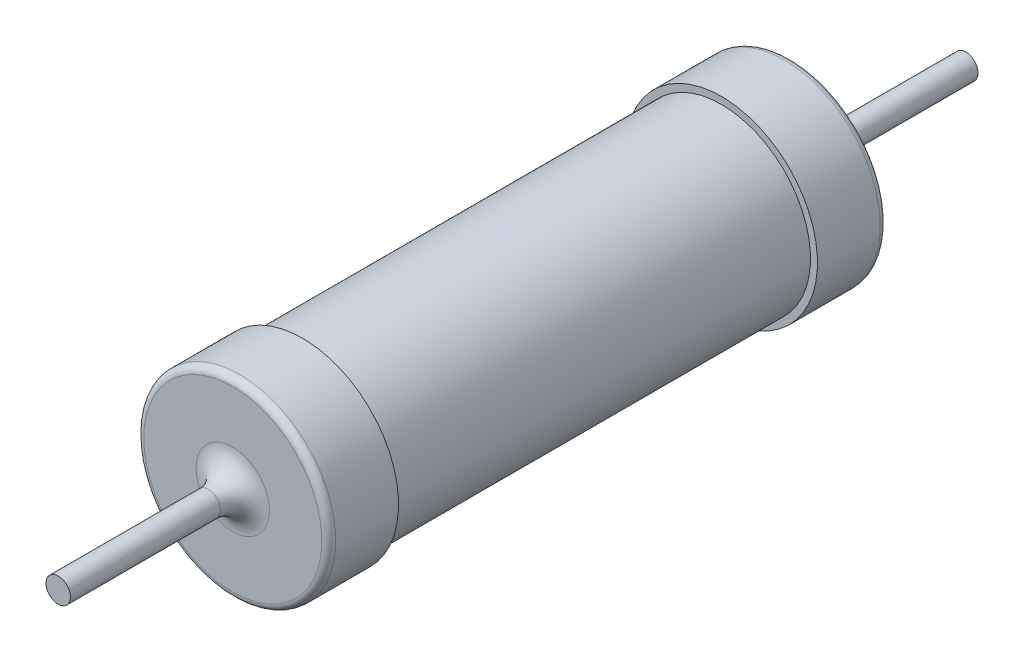
ISO-10303-21;
HEADER;
FILE_DESCRIPTION(('STEP AP214'),'2;1');
FILE_NAME('part.step','',(''),(''),'','','');
FILE_SCHEMA(('AUTOMOTIVE_DESIGN { 1 0 10303 214 1 1 1 1 }'));
ENDSEC;
DATA;
#1=APPLICATION_CONTEXT('core data for automotive mechanical design processes');
#2=APPLICATION_PROTOCOL_DEFINITION('international standard','automotive_design',2000,#1);
#3=PRODUCT_CONTEXT('',#1,'mechanical');
#4=PRODUCT('Part','Part','',(#3));
#5=PRODUCT_RELATED_PRODUCT_CATEGORY('part','',(#4));
#6=PRODUCT_DEFINITION_FORMATION('','',#4);
#7=PRODUCT_DEFINITION_CONTEXT('part definition',#1,'design');
#8=PRODUCT_DEFINITION('design','',#6,#7);
#9=PRODUCT_DEFINITION_SHAPE('','',#8);
#10=(LENGTH_UNIT() NAMED_UNIT(*) SI_UNIT(.MILLI.,.METRE.));
#11=(NAMED_UNIT(*) PLANE_ANGLE_UNIT() SI_UNIT($,.RADIAN.));
#12=(NAMED_UNIT(*) SI_UNIT($,.STERADIAN.) SOLID_ANGLE_UNIT());
#13=UNCERTAINTY_MEASURE_WITH_UNIT(LENGTH_MEASURE(1.E-05),#10,'distance_accuracy_value','');
#14=(GEOMETRIC_REPRESENTATION_CONTEXT(3) GLOBAL_UNCERTAINTY_ASSIGNED_CONTEXT((#13)) GLOBAL_UNIT_ASSIGNED_CONTEXT((#10,
#11,#12)) REPRESENTATION_CONTEXT('',''));
#15=CARTESIAN_POINT('',(0.,0.,0.));
#16=DIRECTION('',(0.,0.,1.));
#17=DIRECTION('',(1.,0.,0.));
#18=AXIS2_PLACEMENT_3D('',#15,#16,#17);
#19=CARTESIAN_POINT('',(0.,0.,6.));
#20=DIRECTION('',(0.,0.,1.));
#21=DIRECTION('',(1.,0.,0.));
#22=AXIS2_PLACEMENT_3D('',#19,#20,#21);
#23=CYLINDRICAL_SURFACE('',#22,2.75);
#24=CARTESIAN_POINT('',(0.,0.,7.8));
#25=DIRECTION('',(0.,0.,-1.));
#26=DIRECTION('',(-1.,0.,0.));
#27=AXIS2_PLACEMENT_3D('',#24,#25,#26);
#28=CIRCLE('',#27,2.75);
#29=CARTESIAN_POINT('',(-2.75,0.,7.8));
#30=VERTEX_POINT('',#29);
#31=EDGE_CURVE('E55',#30,#30,#28,.T.);
#32=ORIENTED_EDGE('',*,*,#31,.T.);
#33=EDGE_LOOP('',(#32));
#34=FACE_BOUND('',#33,.T.);
#35=CARTESIAN_POINT('',(0.,0.,6.));
#36=DIRECTION('',(0.,0.,1.));
#37=DIRECTION('',(-1.,0.,0.));
#38=AXIS2_PLACEMENT_3D('',#35,#36,#37);
#39=CIRCLE('',#38,2.75);
#40=CARTESIAN_POINT('',(-2.75,0.,6.));
#41=VERTEX_POINT('',#40);
#42=EDGE_CURVE('E68',#41,#41,#39,.T.);
#43=ORIENTED_EDGE('',*,*,#42,.T.);
#44=EDGE_LOOP('',(#43));
#45=FACE_BOUND('',#44,.T.);
#46=ADVANCED_FACE('F35',(#34,#45),#23,.T.);
#47=CARTESIAN_POINT('',(0.,0.,6.));
#48=DIRECTION('',(0.,0.,-1.));
#49=DIRECTION('',(-1.,0.,0.));
#50=AXIS2_PLACEMENT_3D('',#47,#48,#49);
#51=PLANE('',#50);
#52=CARTESIAN_POINT('',(0.,0.,6.));
#53=DIRECTION('',(0.,0.,-1.));
#54=DIRECTION('',(-1.,0.,0.));
#55=AXIS2_PLACEMENT_3D('',#52,#53,#54);
#56=CIRCLE('',#55,2.55);
#57=CARTESIAN_POINT('',(-2.55,0.,6.));
#58=VERTEX_POINT('',#57);
#59=EDGE_CURVE('E67',#58,#58,#56,.T.);
#60=ORIENTED_EDGE('',*,*,#59,.F.);
#61=EDGE_LOOP('',(#60));
#62=FACE_BOUND('',#61,.T.);
#63=ORIENTED_EDGE('',*,*,#42,.F.);
#64=EDGE_LOOP('',(#63));
#65=FACE_BOUND('',#64,.T.);
#66=ADVANCED_FACE('F102',(#62,#65),#51,.T.);
#67=CARTESIAN_POINT('',(0.,0.,8.));
#68=DIRECTION('',(0.,0.,-1.));
#69=DIRECTION('',(-1.,0.,0.));
#70=AXIS2_PLACEMENT_3D('',#67,#68,#69);
#71=PLANE('',#70);
#72=CARTESIAN_POINT('',(0.,0.,8.));
#73=DIRECTION('',(0.,0.,-1.));
#74=DIRECTION('',(-1.,0.,0.));
#75=AXIS2_PLACEMENT_3D('',#72,#73,#74);
#76=CIRCLE('',#75,1.05);
#77=CARTESIAN_POINT('',(-1.05,0.,8.));
#78=VERTEX_POINT('',#77);
#79=EDGE_CURVE('E46',#78,#78,#76,.T.);
#80=ORIENTED_EDGE('',*,*,#79,.T.);
#81=EDGE_LOOP('',(#80));
#82=FACE_BOUND('',#81,.T.);
#83=CARTESIAN_POINT('',(0.,0.,8.));
#84=DIRECTION('',(0.,0.,-1.));
#85=DIRECTION('',(-1.,0.,0.));
#86=AXIS2_PLACEMENT_3D('',#83,#84,#85);
#87=CIRCLE('',#86,2.55);
#88=CARTESIAN_POINT('',(-2.55,0.,8.));
#89=VERTEX_POINT('',#88);
#90=EDGE_CURVE('E58',#89,#89,#87,.F.);
#91=ORIENTED_EDGE('',*,*,#90,.T.);
#92=EDGE_LOOP('',(#91));
#93=FACE_BOUND('',#92,.T.);
#94=ADVANCED_FACE('F108',(#82,#93),#71,.F.);
#95=CARTESIAN_POINT('',(0.,0.,-6.));
#96=DIRECTION('',(0.,0.,1.));
#97=DIRECTION('',(1.,0.,0.));
#98=AXIS2_PLACEMENT_3D('',#95,#96,#97);
#99=CYLINDRICAL_SURFACE('',#98,2.55);
#100=CARTESIAN_POINT('',(0.,0.,-6.));
#101=DIRECTION('',(0.,0.,-1.));
#102=DIRECTION('',(-1.,0.,0.));
#103=AXIS2_PLACEMENT_3D('',#100,#101,#102);
#104=CIRCLE('',#103,2.55);
#105=CARTESIAN_POINT('',(-2.55,0.,-6.));
#106=VERTEX_POINT('',#105);
#107=EDGE_CURVE('E71',#106,#106,#104,.T.);
#108=ORIENTED_EDGE('',*,*,#107,.F.);
#109=EDGE_LOOP('',(#108));
#110=FACE_BOUND('',#109,.T.);
#111=ORIENTED_EDGE('',*,*,#59,.T.);
#112=EDGE_LOOP('',(#111));
#113=FACE_BOUND('',#112,.T.);
#114=ADVANCED_FACE('F148',(#110,#113),#99,.T.);
#115=CARTESIAN_POINT('',(0.,0.,-8.));
#116=DIRECTION('',(0.,0.,1.));
#117=DIRECTION('',(1.,0.,0.));
#118=AXIS2_PLACEMENT_3D('',#115,#116,#117);
#119=CYLINDRICAL_SURFACE('',#118,2.75);
#120=CARTESIAN_POINT('',(0.,0.,-7.8));
#121=DIRECTION('',(0.,0.,-1.));
#122=DIRECTION('',(-1.,0.,0.));
#123=AXIS2_PLACEMENT_3D('',#120,#121,#122);
#124=CIRCLE('',#123,2.75);
#125=CARTESIAN_POINT('',(-2.75,0.,-7.8));
#126=VERTEX_POINT('',#125);
#127=EDGE_CURVE('E64',#126,#126,#124,.F.);
#128=ORIENTED_EDGE('',*,*,#127,.T.);
#129=EDGE_LOOP('',(#128));
#130=FACE_BOUND('',#129,.T.);
#131=CARTESIAN_POINT('',(0.,0.,-6.));
#132=DIRECTION('',(0.,0.,1.));
#133=DIRECTION('',(-1.,0.,0.));
#134=AXIS2_PLACEMENT_3D('',#131,#132,#133);
#135=CIRCLE('',#134,2.75);
#136=CARTESIAN_POINT('',(-2.75,0.,-6.));
#137=VERTEX_POINT('',#136);
#138=EDGE_CURVE('E76',#137,#137,#135,.T.);
#139=ORIENTED_EDGE('',*,*,#138,.F.);
#140=EDGE_LOOP('',(#139));
#141=FACE_BOUND('',#140,.T.);
#142=ADVANCED_FACE('F144',(#130,#141),#119,.T.);
#143=CARTESIAN_POINT('',(0.,0.,-8.));
#144=DIRECTION('',(0.,0.,-1.));
#145=DIRECTION('',(-1.,0.,0.));
#146=AXIS2_PLACEMENT_3D('',#143,#144,#145);
#147=PLANE('',#146);
#148=CARTESIAN_POINT('',(0.,0.,-8.));
#149=DIRECTION('',(0.,0.,-1.));
#150=DIRECTION('',(-1.,0.,0.));
#151=AXIS2_PLACEMENT_3D('',#148,#149,#150);
#152=CIRCLE('',#151,1.05);
#153=CARTESIAN_POINT('',(-1.05,0.,-8.));
#154=VERTEX_POINT('',#153);
#155=EDGE_CURVE('E10',#154,#154,#152,.F.);
#156=ORIENTED_EDGE('',*,*,#155,.T.);
#157=EDGE_LOOP('',(#156));
#158=FACE_BOUND('',#157,.T.);
#159=CARTESIAN_POINT('',(0.,0.,-8.));
#160=DIRECTION('',(0.,0.,-1.));
#161=DIRECTION('',(-1.,0.,0.));
#162=AXIS2_PLACEMENT_3D('',#159,#160,#161);
#163=CIRCLE('',#162,2.55);
#164=CARTESIAN_POINT('',(-2.55,0.,-8.));
#165=VERTEX_POINT('',#164);
#166=EDGE_CURVE('E61',#165,#165,#163,.T.);
#167=ORIENTED_EDGE('',*,*,#166,.T.);
#168=EDGE_LOOP('',(#167));
#169=FACE_BOUND('',#168,.T.);
#170=ADVANCED_FACE('F139',(#158,#169),#147,.T.);
#171=CARTESIAN_POINT('',(0.,0.,-6.));
#172=DIRECTION('',(0.,0.,-1.));
#173=DIRECTION('',(-1.,0.,0.));
#174=AXIS2_PLACEMENT_3D('',#171,#172,#173);
#175=PLANE('',#174);
#176=ORIENTED_EDGE('',*,*,#107,.T.);
#177=EDGE_LOOP('',(#176));
#178=FACE_BOUND('',#177,.T.);
#179=ORIENTED_EDGE('',*,*,#138,.T.);
#180=EDGE_LOOP('',(#179));
#181=FACE_BOUND('',#180,.T.);
#182=ADVANCED_FACE('F133',(#178,#181),#175,.F.);
#183=CARTESIAN_POINT('',(0.,0.,13.));
#184=DIRECTION('',(0.,0.,-1.));
#185=DIRECTION('',(-1.,0.,0.));
#186=AXIS2_PLACEMENT_3D('',#183,#184,#185);
#187=CYLINDRICAL_SURFACE('',#186,0.35);
#188=CARTESIAN_POINT('',(0.,0.,8.7));
#189=DIRECTION('',(0.,0.,-1.));
#190=DIRECTION('',(-1.,0.,0.));
#191=AXIS2_PLACEMENT_3D('',#188,#189,#190);
#192=CIRCLE('',#191,0.35);
#193=CARTESIAN_POINT('',(-0.35,0.,8.7));
#194=VERTEX_POINT('',#193);
#195=EDGE_CURVE('E50',#194,#194,#192,.F.);
#196=ORIENTED_EDGE('',*,*,#195,.T.);
#197=EDGE_LOOP('',(#196));
#198=FACE_BOUND('',#197,.T.);
#199=CARTESIAN_POINT('',(0.,0.,13.));
#200=DIRECTION('',(0.,0.,1.));
#201=DIRECTION('',(1.,0.,0.));
#202=AXIS2_PLACEMENT_3D('',#199,#200,#201);
#203=CIRCLE('',#202,0.35);
#204=CARTESIAN_POINT('',(0.35,0.,13.));
#205=VERTEX_POINT('',#204);
#206=EDGE_CURVE('E79',#205,#205,#203,.T.);
#207=ORIENTED_EDGE('',*,*,#206,.F.);
#208=EDGE_LOOP('',(#207));
#209=FACE_BOUND('',#208,.T.);
#210=ADVANCED_FACE('F98',(#198,#209),#187,.T.);
#211=CARTESIAN_POINT('',(0.,0.,13.));
#212=DIRECTION('',(0.,0.,1.));
#213=DIRECTION('',(1.,0.,0.));
#214=AXIS2_PLACEMENT_3D('',#211,#212,#213);
#215=PLANE('',#214);
#216=ORIENTED_EDGE('',*,*,#206,.T.);
#217=EDGE_LOOP('',(#216));
#218=FACE_BOUND('',#217,.T.);
#219=ADVANCED_FACE('F90',(#218),#215,.T.);
#220=CARTESIAN_POINT('',(0.,0.,-13.));
#221=DIRECTION('',(0.,0.,1.));
#222=DIRECTION('',(1.,0.,0.));
#223=AXIS2_PLACEMENT_3D('',#220,#221,#222);
#224=CYLINDRICAL_SURFACE('',#223,0.35);
#225=CARTESIAN_POINT('',(0.,0.,-8.7));
#226=DIRECTION('',(0.,0.,-1.));
#227=DIRECTION('',(-1.,0.,0.));
#228=AXIS2_PLACEMENT_3D('',#225,#226,#227);
#229=CIRCLE('',#228,0.35);
#230=CARTESIAN_POINT('',(-0.35,0.,-8.7));
#231=VERTEX_POINT('',#230);
#232=EDGE_CURVE('E42',#231,#231,#229,.T.);
#233=ORIENTED_EDGE('',*,*,#232,.T.);
#234=EDGE_LOOP('',(#233));
#235=FACE_BOUND('',#234,.T.);
#236=CARTESIAN_POINT('',(0.,0.,-13.));
#237=DIRECTION('',(0.,0.,-1.));
#238=DIRECTION('',(-1.,0.,0.));
#239=AXIS2_PLACEMENT_3D('',#236,#237,#238);
#240=CIRCLE('',#239,0.35);
#241=CARTESIAN_POINT('',(-0.35,0.,-13.));
#242=VERTEX_POINT('',#241);
#243=EDGE_CURVE('E82',#242,#242,#240,.T.);
#244=ORIENTED_EDGE('',*,*,#243,.F.);
#245=EDGE_LOOP('',(#244));
#246=FACE_BOUND('',#245,.T.);
#247=ADVANCED_FACE('F88',(#235,#246),#224,.T.);
#248=CARTESIAN_POINT('',(0.,0.,-13.));
#249=DIRECTION('',(0.,0.,-1.));
#250=DIRECTION('',(-1.,0.,0.));
#251=AXIS2_PLACEMENT_3D('',#248,#249,#250);
#252=PLANE('',#251);
#253=ORIENTED_EDGE('',*,*,#243,.T.);
#254=EDGE_LOOP('',(#253));
#255=FACE_BOUND('',#254,.T.);
#256=ADVANCED_FACE('F86',(#255),#252,.T.);
#257=CARTESIAN_POINT('',(0.,0.,-7.8));
#258=DIRECTION('',(0.,0.,-1.));
#259=DIRECTION('',(-1.,0.,0.));
#260=AXIS2_PLACEMENT_3D('',#257,#258,#259);
#261=TOROIDAL_SURFACE('',#260,2.55,0.2);
#262=ORIENTED_EDGE('',*,*,#166,.F.);
#263=EDGE_LOOP('',(#262));
#264=FACE_BOUND('',#263,.T.);
#265=ORIENTED_EDGE('',*,*,#127,.F.);
#266=EDGE_LOOP('',(#265));
#267=FACE_BOUND('',#266,.T.);
#268=ADVANCED_FACE('F96',(#264,#267),#261,.T.);
#269=CARTESIAN_POINT('',(0.,0.,7.8));
#270=DIRECTION('',(0.,0.,-1.));
#271=DIRECTION('',(-1.,0.,0.));
#272=AXIS2_PLACEMENT_3D('',#269,#270,#271);
#273=TOROIDAL_SURFACE('',#272,2.55,0.2);
#274=ORIENTED_EDGE('',*,*,#31,.F.);
#275=EDGE_LOOP('',(#274));
#276=FACE_BOUND('',#275,.T.);
#277=ORIENTED_EDGE('',*,*,#90,.F.);
#278=EDGE_LOOP('',(#277));
#279=FACE_BOUND('',#278,.T.);
#280=ADVANCED_FACE('F116',(#276,#279),#273,.T.);
#281=CARTESIAN_POINT('',(0.,0.,8.7));
#282=DIRECTION('',(0.,0.,-1.));
#283=DIRECTION('',(-1.,0.,0.));
#284=AXIS2_PLACEMENT_3D('',#281,#282,#283);
#285=TOROIDAL_SURFACE('',#284,1.05,0.7);
#286=ORIENTED_EDGE('',*,*,#79,.F.);
#287=EDGE_LOOP('',(#286));
#288=FACE_BOUND('',#287,.T.);
#289=ORIENTED_EDGE('',*,*,#195,.F.);
#290=EDGE_LOOP('',(#289));
#291=FACE_BOUND('',#290,.T.);
#292=ADVANCED_FACE('F119',(#288,#291),#285,.F.);
#293=CARTESIAN_POINT('',(0.,0.,-8.7));
#294=DIRECTION('',(0.,0.,-1.));
#295=DIRECTION('',(-1.,0.,0.));
#296=AXIS2_PLACEMENT_3D('',#293,#294,#295);
#297=TOROIDAL_SURFACE('',#296,1.05,0.7);
#298=ORIENTED_EDGE('',*,*,#155,.F.);
#299=EDGE_LOOP('',(#298));
#300=FACE_BOUND('',#299,.T.);
#301=ORIENTED_EDGE('',*,*,#232,.F.);
#302=EDGE_LOOP('',(#301));
#303=FACE_BOUND('',#302,.T.);
#304=ADVANCED_FACE('F37',(#300,#303),#297,.F.);
#305=CLOSED_SHELL('',(#46,#66,#94,#114,#142,#170,#182,#210,#219,#247,#256,#268,#280,#292,#304));
#306=MANIFOLD_SOLID_BREP('B2',#305);
#307=ADVANCED_BREP_SHAPE_REPRESENTATION('',(#18,#306),#14);
#308=SHAPE_DEFINITION_REPRESENTATION(#9,#307);
ENDSEC;
END-ISO-10303-21;
